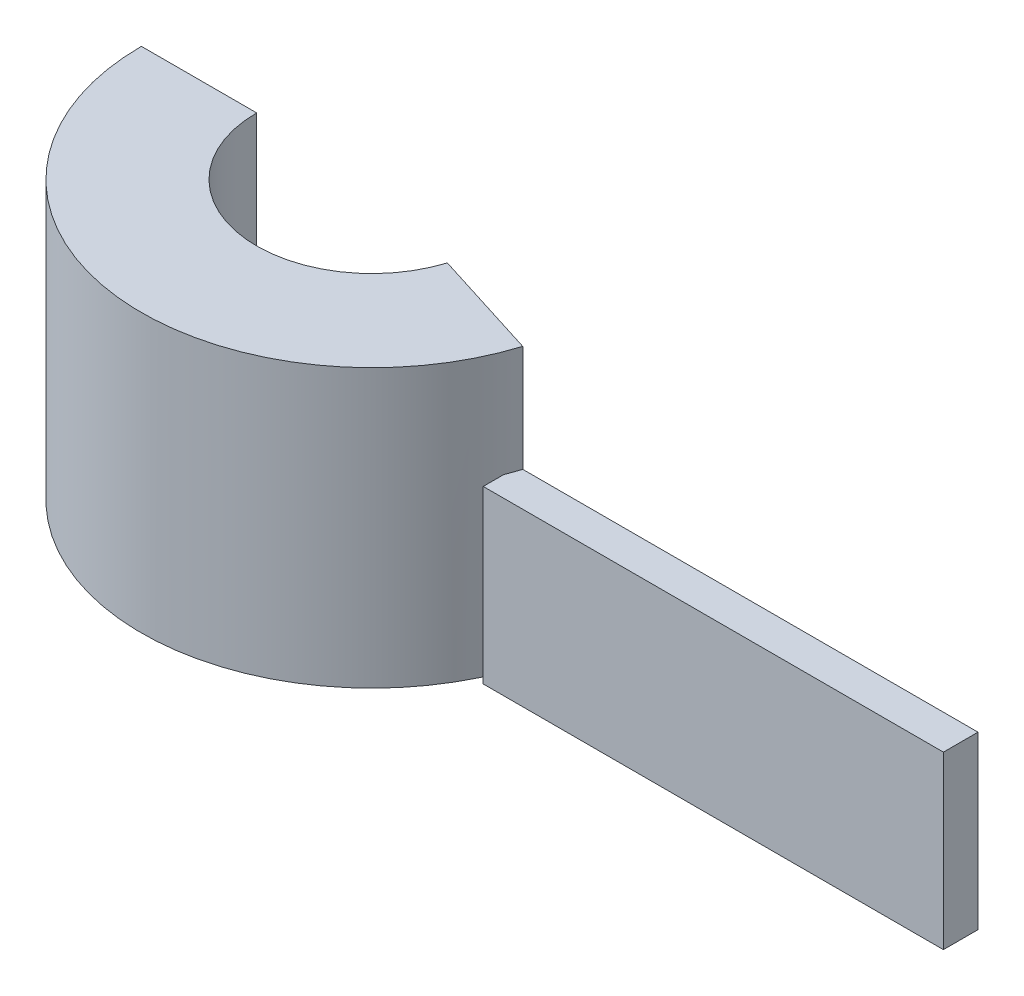
ISO-10303-21;
HEADER;
FILE_DESCRIPTION(('STEP AP214'),'2;1');
FILE_NAME('part.step','',(''),(''),'','','');
FILE_SCHEMA(('AUTOMOTIVE_DESIGN { 1 0 10303 214 1 1 1 1 }'));
ENDSEC;
DATA;
#1=APPLICATION_CONTEXT('core data for automotive mechanical design processes');
#2=APPLICATION_PROTOCOL_DEFINITION('international standard','automotive_design',2000,#1);
#3=PRODUCT_CONTEXT('',#1,'mechanical');
#4=PRODUCT('Part','Part','',(#3));
#5=PRODUCT_RELATED_PRODUCT_CATEGORY('part','',(#4));
#6=PRODUCT_DEFINITION_FORMATION('','',#4);
#7=PRODUCT_DEFINITION_CONTEXT('part definition',#1,'design');
#8=PRODUCT_DEFINITION('design','',#6,#7);
#9=PRODUCT_DEFINITION_SHAPE('','',#8);
#10=(LENGTH_UNIT() NAMED_UNIT(*) SI_UNIT(.MILLI.,.METRE.));
#11=(NAMED_UNIT(*) PLANE_ANGLE_UNIT() SI_UNIT($,.RADIAN.));
#12=(NAMED_UNIT(*) SI_UNIT($,.STERADIAN.) SOLID_ANGLE_UNIT());
#13=UNCERTAINTY_MEASURE_WITH_UNIT(LENGTH_MEASURE(1.E-05),#10,'distance_accuracy_value','');
#14=(GEOMETRIC_REPRESENTATION_CONTEXT(3) GLOBAL_UNCERTAINTY_ASSIGNED_CONTEXT((#13)) GLOBAL_UNIT_ASSIGNED_CONTEXT((#10,
#11,#12)) REPRESENTATION_CONTEXT('',''));
#15=CARTESIAN_POINT('',(0.,0.,0.));
#16=DIRECTION('',(0.,0.,1.));
#17=DIRECTION('',(1.,0.,0.));
#18=AXIS2_PLACEMENT_3D('',#15,#16,#17);
#19=CARTESIAN_POINT('',(0.,-5.83946734915426,0.));
#20=DIRECTION('',(0.,1.,0.));
#21=DIRECTION('',(-1.,0.,0.));
#22=AXIS2_PLACEMENT_3D('',#19,#20,#21);
#23=PLANE('',#22);
#24=CARTESIAN_POINT('',(0.,-5.83946734915426,0.));
#25=DIRECTION('',(0.,1.,0.));
#26=DIRECTION('',(-1.,0.,0.));
#27=AXIS2_PLACEMENT_3D('',#24,#25,#26);
#28=CIRCLE('',#27,9.99999999999999);
#29=CARTESIAN_POINT('',(-9.99999999999999,-5.83946734915426,0.));
#30=VERTEX_POINT('',#29);
#31=CARTESIAN_POINT('',(9.53939201416945,-5.83946734915426,3.));
#32=VERTEX_POINT('',#31);
#33=EDGE_CURVE('E123',#30,#32,#28,.T.);
#34=ORIENTED_EDGE('',*,*,#33,.T.);
#35=DIRECTION('',(0.953939201416946,0.,0.3));
#36=VECTOR('',#35,1.);
#37=CARTESIAN_POINT('',(0.,-5.83946734915426,0.));
#38=LINE('',#37,#36);
#39=CARTESIAN_POINT('',(19.0787840283389,-5.83946734915426,6.));
#40=VERTEX_POINT('',#39);
#41=EDGE_CURVE('E109',#32,#40,#38,.T.);
#42=ORIENTED_EDGE('',*,*,#41,.T.);
#43=DIRECTION('',(-1.,0.,0.));
#44=VECTOR('',#43,1.);
#45=CARTESIAN_POINT('',(0.,-5.83946734915426,6.));
#46=LINE('',#45,#44);
#47=CARTESIAN_POINT('',(58.5667702402718,-5.83946734915426,6.));
#48=VERTEX_POINT('',#47);
#49=EDGE_CURVE('E121',#48,#40,#46,.T.);
#50=ORIENTED_EDGE('',*,*,#49,.F.);
#51=DIRECTION('',(0.,0.,-1.));
#52=VECTOR('',#51,1.);
#53=CARTESIAN_POINT('',(58.5667702402718,-5.83946734915426,9.));
#54=LINE('',#53,#52);
#55=CARTESIAN_POINT('',(58.5667702402718,-5.83946734915426,9.));
#56=VERTEX_POINT('',#55);
#57=EDGE_CURVE('E140',#56,#48,#54,.T.);
#58=ORIENTED_EDGE('',*,*,#57,.F.);
#59=DIRECTION('',(-1.,0.,0.));
#60=VECTOR('',#59,1.);
#61=CARTESIAN_POINT('',(0.,-5.83946734915426,9.));
#62=LINE('',#61,#60);
#63=CARTESIAN_POINT('',(18.649913335324,-5.83946734915426,9.));
#64=VERTEX_POINT('',#63);
#65=EDGE_CURVE('E139',#56,#64,#62,.T.);
#66=ORIENTED_EDGE('',*,*,#65,.T.);
#67=DIRECTION('',(0.,0.,-1.));
#68=VECTOR('',#67,1.);
#69=CARTESIAN_POINT('',(18.649913335324,-5.83946734915426,9.));
#70=LINE('',#69,#68);
#71=CARTESIAN_POINT('',(18.649913335324,-5.83946734915426,7.22362323110119));
#72=VERTEX_POINT('',#71);
#73=EDGE_CURVE('E149',#64,#72,#70,.T.);
#74=ORIENTED_EDGE('',*,*,#73,.T.);
#75=CARTESIAN_POINT('',(0.,-5.83946734915426,0.));
#76=DIRECTION('',(0.,1.,0.));
#77=DIRECTION('',(-1.,0.,0.));
#78=AXIS2_PLACEMENT_3D('',#75,#76,#77);
#79=CIRCLE('',#78,20.);
#80=CARTESIAN_POINT('',(-20.,-5.83946734915427,-1.39659253553725E-13));
#81=VERTEX_POINT('',#80);
#82=EDGE_CURVE('E60',#81,#72,#79,.T.);
#83=ORIENTED_EDGE('',*,*,#82,.F.);
#84=DIRECTION('',(-1.,0.,0.));
#85=VECTOR('',#84,1.);
#86=CARTESIAN_POINT('',(0.,-5.83946734915426,0.));
#87=LINE('',#86,#85);
#88=EDGE_CURVE('E142',#30,#81,#87,.T.);
#89=ORIENTED_EDGE('',*,*,#88,.F.);
#90=EDGE_LOOP('',(#34,#42,#50,#58,#66,#74,#83,#89));
#91=FACE_BOUND('',#90,.T.);
#92=ADVANCED_FACE('F42',(#91),#23,.F.);
#93=CARTESIAN_POINT('',(0.,-3.03946734915426,0.));
#94=DIRECTION('',(0.,1.,0.));
#95=DIRECTION('',(-1.,0.,0.));
#96=AXIS2_PLACEMENT_3D('',#93,#94,#95);
#97=CYLINDRICAL_SURFACE('',#96,20.);
#98=DIRECTION('',(0.,-1.,0.));
#99=VECTOR('',#98,1.);
#100=CARTESIAN_POINT('',(19.0787840283389,0.,6.));
#101=LINE('',#100,#99);
#102=CARTESIAN_POINT('',(19.0787840283389,18.2348368108457,6.));
#103=VERTEX_POINT('',#102);
#104=CARTESIAN_POINT('',(19.0787840283389,9.,6.));
#105=VERTEX_POINT('',#104);
#106=EDGE_CURVE('E112',#103,#105,#101,.T.);
#107=ORIENTED_EDGE('',*,*,#106,.F.);
#108=CARTESIAN_POINT('',(0.,18.2348368108457,0.));
#109=DIRECTION('',(0.,1.,0.));
#110=DIRECTION('',(-1.,0.,0.));
#111=AXIS2_PLACEMENT_3D('',#108,#109,#110);
#112=CIRCLE('',#111,20.);
#113=CARTESIAN_POINT('',(-20.,18.2348368108457,-1.39659253553725E-13));
#114=VERTEX_POINT('',#113);
#115=EDGE_CURVE('E166',#114,#103,#112,.T.);
#116=ORIENTED_EDGE('',*,*,#115,.F.);
#117=DIRECTION('',(0.,-1.,0.));
#118=VECTOR('',#117,1.);
#119=CARTESIAN_POINT('',(-20.,0.,-1.39659253553725E-13));
#120=LINE('',#119,#118);
#121=EDGE_CURVE('E154',#114,#81,#120,.T.);
#122=ORIENTED_EDGE('',*,*,#121,.T.);
#123=ORIENTED_EDGE('',*,*,#82,.T.);
#124=DIRECTION('',(0.,1.,0.));
#125=VECTOR('',#124,1.);
#126=CARTESIAN_POINT('',(18.649913335324,-3.03946734915426,7.2236232311012));
#127=LINE('',#126,#125);
#128=CARTESIAN_POINT('',(18.649913335324,9.00000000000001,7.2236232311012));
#129=VERTEX_POINT('',#128);
#130=EDGE_CURVE('E12',#129,#72,#127,.F.);
#131=ORIENTED_EDGE('',*,*,#130,.F.);
#132=CARTESIAN_POINT('',(0.,9.00000000000002,0.));
#133=DIRECTION('',(0.,-1.,0.));
#134=DIRECTION('',(1.,0.,0.));
#135=AXIS2_PLACEMENT_3D('',#132,#133,#134);
#136=CIRCLE('',#135,20.);
#137=EDGE_CURVE('E50',#129,#105,#136,.F.);
#138=ORIENTED_EDGE('',*,*,#137,.T.);
#139=EDGE_LOOP('',(#107,#116,#122,#123,#131,#138));
#140=FACE_BOUND('',#139,.T.);
#141=ADVANCED_FACE('F44',(#140),#97,.T.);
#142=CARTESIAN_POINT('',(0.,18.2348368108457,0.));
#143=DIRECTION('',(0.,-1.,0.));
#144=DIRECTION('',(1.,0.,0.));
#145=AXIS2_PLACEMENT_3D('',#142,#143,#144);
#146=PLANE('',#145);
#147=ORIENTED_EDGE('',*,*,#115,.T.);
#148=DIRECTION('',(-0.953939201416946,0.,-0.3));
#149=VECTOR('',#148,1.);
#150=CARTESIAN_POINT('',(0.,18.2348368108457,0.));
#151=LINE('',#150,#149);
#152=CARTESIAN_POINT('',(9.53939201416945,18.2348368108457,3.));
#153=VERTEX_POINT('',#152);
#154=EDGE_CURVE('E132',#103,#153,#151,.T.);
#155=ORIENTED_EDGE('',*,*,#154,.T.);
#156=CARTESIAN_POINT('',(0.,18.2348368108457,0.));
#157=DIRECTION('',(0.,1.,0.));
#158=DIRECTION('',(-1.,0.,0.));
#159=AXIS2_PLACEMENT_3D('',#156,#157,#158);
#160=CIRCLE('',#159,10.);
#161=CARTESIAN_POINT('',(-10.,18.2348368108457,0.));
#162=VERTEX_POINT('',#161);
#163=EDGE_CURVE('E163',#162,#153,#160,.T.);
#164=ORIENTED_EDGE('',*,*,#163,.F.);
#165=DIRECTION('',(1.,0.,0.));
#166=VECTOR('',#165,1.);
#167=CARTESIAN_POINT('',(0.,18.2348368108457,0.));
#168=LINE('',#167,#166);
#169=EDGE_CURVE('E156',#114,#162,#168,.T.);
#170=ORIENTED_EDGE('',*,*,#169,.F.);
#171=EDGE_LOOP('',(#147,#155,#164,#170));
#172=FACE_BOUND('',#171,.T.);
#173=ADVANCED_FACE('F188',(#172),#146,.F.);
#174=CARTESIAN_POINT('',(0.,-3.03946734915426,0.));
#175=DIRECTION('',(0.,1.,0.));
#176=DIRECTION('',(-1.,0.,0.));
#177=AXIS2_PLACEMENT_3D('',#174,#175,#176);
#178=CYLINDRICAL_SURFACE('',#177,10.);
#179=ORIENTED_EDGE('',*,*,#163,.T.);
#180=DIRECTION('',(0.,-1.,0.));
#181=VECTOR('',#180,1.);
#182=CARTESIAN_POINT('',(9.53939201416945,0.,3.));
#183=LINE('',#182,#181);
#184=EDGE_CURVE('E129',#153,#32,#183,.T.);
#185=ORIENTED_EDGE('',*,*,#184,.T.);
#186=ORIENTED_EDGE('',*,*,#33,.F.);
#187=DIRECTION('',(0.,-1.,0.));
#188=VECTOR('',#187,1.);
#189=CARTESIAN_POINT('',(-10.,0.,0.));
#190=LINE('',#189,#188);
#191=EDGE_CURVE('E159',#162,#30,#190,.T.);
#192=ORIENTED_EDGE('',*,*,#191,.F.);
#193=EDGE_LOOP('',(#179,#185,#186,#192));
#194=FACE_BOUND('',#193,.T.);
#195=ADVANCED_FACE('F192',(#194),#178,.F.);
#196=CARTESIAN_POINT('',(0.,0.,0.));
#197=DIRECTION('',(0.,0.,-1.));
#198=DIRECTION('',(-1.,0.,0.));
#199=AXIS2_PLACEMENT_3D('',#196,#197,#198);
#200=PLANE('',#199);
#201=ORIENTED_EDGE('',*,*,#88,.T.);
#202=ORIENTED_EDGE('',*,*,#121,.F.);
#203=ORIENTED_EDGE('',*,*,#169,.T.);
#204=ORIENTED_EDGE('',*,*,#191,.T.);
#205=EDGE_LOOP('',(#201,#202,#203,#204));
#206=FACE_BOUND('',#205,.T.);
#207=ADVANCED_FACE('F194',(#206),#200,.T.);
#208=CARTESIAN_POINT('',(58.5667702402718,0.,9.));
#209=DIRECTION('',(-1.,0.,0.));
#210=DIRECTION('',(0.,0.,1.));
#211=AXIS2_PLACEMENT_3D('',#208,#209,#210);
#212=PLANE('',#211);
#213=DIRECTION('',(0.,1.,0.));
#214=VECTOR('',#213,1.);
#215=CARTESIAN_POINT('',(58.5667702402718,0.,6.));
#216=LINE('',#215,#214);
#217=CARTESIAN_POINT('',(58.5667702402718,8.99999999999996,6.));
#218=VERTEX_POINT('',#217);
#219=EDGE_CURVE('E127',#48,#218,#216,.T.);
#220=ORIENTED_EDGE('',*,*,#219,.T.);
#221=DIRECTION('',(0.,0.,-1.));
#222=VECTOR('',#221,1.);
#223=CARTESIAN_POINT('',(58.5667702402718,8.99999999999996,9.));
#224=LINE('',#223,#222);
#225=CARTESIAN_POINT('',(58.5667702402718,8.99999999999996,9.));
#226=VERTEX_POINT('',#225);
#227=EDGE_CURVE('E143',#226,#218,#224,.T.);
#228=ORIENTED_EDGE('',*,*,#227,.F.);
#229=DIRECTION('',(0.,1.,0.));
#230=VECTOR('',#229,1.);
#231=CARTESIAN_POINT('',(58.5667702402718,0.,9.));
#232=LINE('',#231,#230);
#233=EDGE_CURVE('E135',#56,#226,#232,.T.);
#234=ORIENTED_EDGE('',*,*,#233,.F.);
#235=ORIENTED_EDGE('',*,*,#57,.T.);
#236=EDGE_LOOP('',(#220,#228,#234,#235));
#237=FACE_BOUND('',#236,.T.);
#238=ADVANCED_FACE('F200',(#237),#212,.F.);
#239=CARTESIAN_POINT('',(0.,9.00000000000002,9.));
#240=DIRECTION('',(0.,-1.,0.));
#241=DIRECTION('',(1.,0.,0.));
#242=AXIS2_PLACEMENT_3D('',#239,#240,#241);
#243=PLANE('',#242);
#244=ORIENTED_EDGE('',*,*,#137,.F.);
#245=DIRECTION('',(0.,0.,-1.));
#246=VECTOR('',#245,1.);
#247=CARTESIAN_POINT('',(18.649913335324,9.00000000000001,9.));
#248=LINE('',#247,#246);
#249=CARTESIAN_POINT('',(18.649913335324,9.00000000000001,9.));
#250=VERTEX_POINT('',#249);
#251=EDGE_CURVE('E146',#250,#129,#248,.T.);
#252=ORIENTED_EDGE('',*,*,#251,.F.);
#253=DIRECTION('',(-1.,0.,0.));
#254=VECTOR('',#253,1.);
#255=CARTESIAN_POINT('',(0.,9.00000000000002,9.));
#256=LINE('',#255,#254);
#257=EDGE_CURVE('E181',#226,#250,#256,.T.);
#258=ORIENTED_EDGE('',*,*,#257,.F.);
#259=ORIENTED_EDGE('',*,*,#227,.T.);
#260=DIRECTION('',(-1.,0.,0.));
#261=VECTOR('',#260,1.);
#262=CARTESIAN_POINT('',(0.,9.00000000000002,6.));
#263=LINE('',#262,#261);
#264=EDGE_CURVE('E128',#218,#105,#263,.T.);
#265=ORIENTED_EDGE('',*,*,#264,.T.);
#266=EDGE_LOOP('',(#244,#252,#258,#259,#265));
#267=FACE_BOUND('',#266,.T.);
#268=ADVANCED_FACE('F171',(#267),#243,.F.);
#269=CARTESIAN_POINT('',(18.649913335324,0.,9.));
#270=DIRECTION('',(-1.,0.,0.));
#271=DIRECTION('',(0.,0.,1.));
#272=AXIS2_PLACEMENT_3D('',#269,#270,#271);
#273=PLANE('',#272);
#274=ORIENTED_EDGE('',*,*,#251,.T.);
#275=ORIENTED_EDGE('',*,*,#130,.T.);
#276=ORIENTED_EDGE('',*,*,#73,.F.);
#277=DIRECTION('',(0.,1.,0.));
#278=VECTOR('',#277,1.);
#279=CARTESIAN_POINT('',(18.649913335324,0.,9.));
#280=LINE('',#279,#278);
#281=EDGE_CURVE('E177',#64,#250,#280,.T.);
#282=ORIENTED_EDGE('',*,*,#281,.T.);
#283=EDGE_LOOP('',(#274,#275,#276,#282));
#284=FACE_BOUND('',#283,.T.);
#285=ADVANCED_FACE('F175',(#284),#273,.T.);
#286=CARTESIAN_POINT('',(0.,0.,9.));
#287=DIRECTION('',(0.,0.,-1.));
#288=DIRECTION('',(-1.,0.,0.));
#289=AXIS2_PLACEMENT_3D('',#286,#287,#288);
#290=PLANE('',#289);
#291=ORIENTED_EDGE('',*,*,#65,.F.);
#292=ORIENTED_EDGE('',*,*,#233,.T.);
#293=ORIENTED_EDGE('',*,*,#257,.T.);
#294=ORIENTED_EDGE('',*,*,#281,.F.);
#295=EDGE_LOOP('',(#291,#292,#293,#294));
#296=FACE_BOUND('',#295,.T.);
#297=ADVANCED_FACE('F197',(#296),#290,.F.);
#298=CARTESIAN_POINT('',(0.,0.,6.));
#299=DIRECTION('',(0.,0.,-1.));
#300=DIRECTION('',(-1.,0.,0.));
#301=AXIS2_PLACEMENT_3D('',#298,#299,#300);
#302=PLANE('',#301);
#303=ORIENTED_EDGE('',*,*,#49,.T.);
#304=DIRECTION('',(0.,1.,0.));
#305=VECTOR('',#304,1.);
#306=CARTESIAN_POINT('',(19.0787840283389,-3.03946734915425,6.));
#307=LINE('',#306,#305);
#308=EDGE_CURVE('E106',#40,#105,#307,.T.);
#309=ORIENTED_EDGE('',*,*,#308,.T.);
#310=ORIENTED_EDGE('',*,*,#264,.F.);
#311=ORIENTED_EDGE('',*,*,#219,.F.);
#312=EDGE_LOOP('',(#303,#309,#310,#311));
#313=FACE_BOUND('',#312,.T.);
#314=ADVANCED_FACE('F126',(#313),#302,.T.);
#315=CARTESIAN_POINT('',(0.,0.,0.));
#316=DIRECTION('',(-0.3,0.,0.953939201416946));
#317=DIRECTION('',(0.953939201416946,0.,0.3));
#318=AXIS2_PLACEMENT_3D('',#315,#316,#317);
#319=PLANE('',#318);
#320=ORIENTED_EDGE('',*,*,#41,.F.);
#321=ORIENTED_EDGE('',*,*,#184,.F.);
#322=ORIENTED_EDGE('',*,*,#154,.F.);
#323=ORIENTED_EDGE('',*,*,#106,.T.);
#324=ORIENTED_EDGE('',*,*,#308,.F.);
#325=EDGE_LOOP('',(#320,#321,#322,#323,#324));
#326=FACE_BOUND('',#325,.T.);
#327=ADVANCED_FACE('F108',(#326),#319,.F.);
#328=CLOSED_SHELL('',(#92,#141,#173,#195,#207,#238,#268,#285,#297,#314,#327));
#329=MANIFOLD_SOLID_BREP('B2',#328);
#330=ADVANCED_BREP_SHAPE_REPRESENTATION('',(#18,#329),#14);
#331=SHAPE_DEFINITION_REPRESENTATION(#9,#330);
ENDSEC;
END-ISO-10303-21;
